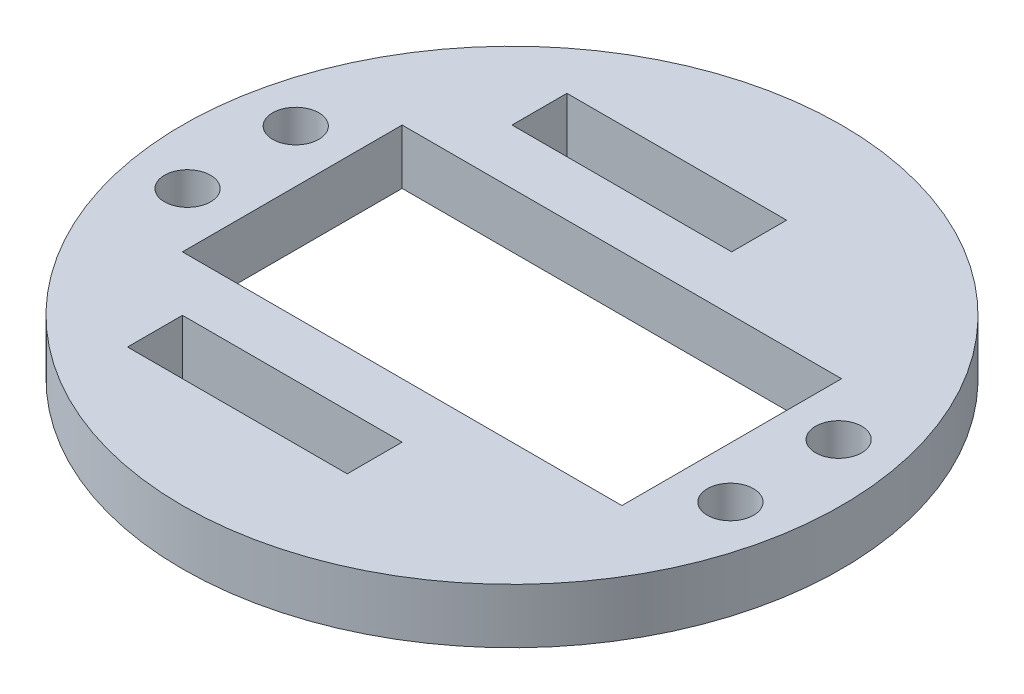
ISO-10303-21;
HEADER;
FILE_DESCRIPTION(('STEP AP214'),'2;1');
FILE_NAME('part.step','',(''),(''),'','','');
FILE_SCHEMA(('AUTOMOTIVE_DESIGN { 1 0 10303 214 1 1 1 1 }'));
ENDSEC;
DATA;
#1=APPLICATION_CONTEXT('core data for automotive mechanical design processes');
#2=APPLICATION_PROTOCOL_DEFINITION('international standard','automotive_design',2000,#1);
#3=PRODUCT_CONTEXT('',#1,'mechanical');
#4=PRODUCT('Part','Part','',(#3));
#5=PRODUCT_RELATED_PRODUCT_CATEGORY('part','',(#4));
#6=PRODUCT_DEFINITION_FORMATION('','',#4);
#7=PRODUCT_DEFINITION_CONTEXT('part definition',#1,'design');
#8=PRODUCT_DEFINITION('design','',#6,#7);
#9=PRODUCT_DEFINITION_SHAPE('','',#8);
#10=(LENGTH_UNIT() NAMED_UNIT(*) SI_UNIT(.MILLI.,.METRE.));
#11=(NAMED_UNIT(*) PLANE_ANGLE_UNIT() SI_UNIT($,.RADIAN.));
#12=(NAMED_UNIT(*) SI_UNIT($,.STERADIAN.) SOLID_ANGLE_UNIT());
#13=UNCERTAINTY_MEASURE_WITH_UNIT(LENGTH_MEASURE(1.E-05),#10,'distance_accuracy_value','');
#14=(GEOMETRIC_REPRESENTATION_CONTEXT(3) GLOBAL_UNCERTAINTY_ASSIGNED_CONTEXT((#13)) GLOBAL_UNIT_ASSIGNED_CONTEXT((#10,
#11,#12)) REPRESENTATION_CONTEXT('',''));
#15=CARTESIAN_POINT('',(0.,0.,0.));
#16=DIRECTION('',(0.,0.,1.));
#17=DIRECTION('',(1.,0.,0.));
#18=AXIS2_PLACEMENT_3D('',#15,#16,#17);
#19=CARTESIAN_POINT('',(0.,5.,0.));
#20=DIRECTION('',(0.,-1.,0.));
#21=DIRECTION('',(0.,0.,-1.));
#22=AXIS2_PLACEMENT_3D('',#19,#20,#21);
#23=CYLINDRICAL_SURFACE('',#22,30.);
#24=CARTESIAN_POINT('',(0.,5.,0.));
#25=DIRECTION('',(0.,1.,0.));
#26=DIRECTION('',(0.,0.,1.));
#27=AXIS2_PLACEMENT_3D('',#24,#25,#26);
#28=CIRCLE('',#27,30.);
#29=CARTESIAN_POINT('',(0.,5.,30.));
#30=VERTEX_POINT('',#29);
#31=EDGE_CURVE('E206',#30,#30,#28,.T.);
#32=ORIENTED_EDGE('',*,*,#31,.F.);
#33=EDGE_LOOP('',(#32));
#34=FACE_BOUND('',#33,.T.);
#35=CARTESIAN_POINT('',(0.,0.,0.));
#36=DIRECTION('',(0.,1.,0.));
#37=DIRECTION('',(0.,0.,1.));
#38=AXIS2_PLACEMENT_3D('',#35,#36,#37);
#39=CIRCLE('',#38,30.);
#40=CARTESIAN_POINT('',(0.,0.,30.));
#41=VERTEX_POINT('',#40);
#42=EDGE_CURVE('E199',#41,#41,#39,.T.);
#43=ORIENTED_EDGE('',*,*,#42,.T.);
#44=EDGE_LOOP('',(#43));
#45=FACE_BOUND('',#44,.T.);
#46=ADVANCED_FACE('F33',(#34,#45),#23,.T.);
#47=CARTESIAN_POINT('',(0.,5.,0.));
#48=DIRECTION('',(0.,1.,0.));
#49=DIRECTION('',(0.,0.,1.));
#50=AXIS2_PLACEMENT_3D('',#47,#48,#49);
#51=PLANE('',#50);
#52=CARTESIAN_POINT('',(24.6611456180001,5.,-5.07499999999998));
#53=DIRECTION('',(0.,-1.,0.));
#54=DIRECTION('',(0.,0.,-1.));
#55=AXIS2_PLACEMENT_3D('',#52,#53,#54);
#56=CIRCLE('',#55,2.10000000000001);
#57=CARTESIAN_POINT('',(24.6611456180001,5.,-7.17499999999999));
#58=VERTEX_POINT('',#57);
#59=EDGE_CURVE('E435',#58,#58,#56,.T.);
#60=ORIENTED_EDGE('',*,*,#59,.T.);
#61=EDGE_LOOP('',(#60));
#62=FACE_BOUND('',#61,.T.);
#63=CARTESIAN_POINT('',(24.6611456180001,5.,4.77500000000002));
#64=DIRECTION('',(0.,-1.,0.));
#65=DIRECTION('',(0.,0.,-1.));
#66=AXIS2_PLACEMENT_3D('',#63,#64,#65);
#67=CIRCLE('',#66,2.10000000000001);
#68=CARTESIAN_POINT('',(24.6611456180001,5.,2.67500000000001));
#69=VERTEX_POINT('',#68);
#70=EDGE_CURVE('E456',#69,#69,#67,.T.);
#71=ORIENTED_EDGE('',*,*,#70,.T.);
#72=EDGE_LOOP('',(#71));
#73=FACE_BOUND('',#72,.T.);
#74=CARTESIAN_POINT('',(-24.7611456180002,5.,4.77500000000002));
#75=DIRECTION('',(0.,-1.,0.));
#76=DIRECTION('',(0.,0.,-1.));
#77=AXIS2_PLACEMENT_3D('',#74,#75,#76);
#78=CIRCLE('',#77,2.10000000000001);
#79=CARTESIAN_POINT('',(-24.7611456180002,5.,2.67500000000001));
#80=VERTEX_POINT('',#79);
#81=EDGE_CURVE('E447',#80,#80,#78,.T.);
#82=ORIENTED_EDGE('',*,*,#81,.T.);
#83=EDGE_LOOP('',(#82));
#84=FACE_BOUND('',#83,.T.);
#85=CARTESIAN_POINT('',(-24.7611456180002,5.,-5.07499999999998));
#86=DIRECTION('',(0.,-1.,0.));
#87=DIRECTION('',(0.,0.,-1.));
#88=AXIS2_PLACEMENT_3D('',#85,#86,#87);
#89=CIRCLE('',#88,2.10000000000001);
#90=CARTESIAN_POINT('',(-24.7611456180002,5.,-7.17499999999999));
#91=VERTEX_POINT('',#90);
#92=EDGE_CURVE('E157',#91,#91,#89,.T.);
#93=ORIENTED_EDGE('',*,*,#92,.T.);
#94=EDGE_LOOP('',(#93));
#95=FACE_BOUND('',#94,.T.);
#96=DIRECTION('',(0.,0.,1.));
#97=VECTOR('',#96,1.);
#98=CARTESIAN_POINT('',(-15.,5.,-15.));
#99=LINE('',#98,#97);
#100=CARTESIAN_POINT('',(-15.,5.,-20.));
#101=VERTEX_POINT('',#100);
#102=CARTESIAN_POINT('',(-15.,5.,-15.));
#103=VERTEX_POINT('',#102);
#104=EDGE_CURVE('E47',#101,#103,#99,.T.);
#105=ORIENTED_EDGE('',*,*,#104,.F.);
#106=DIRECTION('',(-1.,0.,0.));
#107=VECTOR('',#106,1.);
#108=CARTESIAN_POINT('',(-15.,5.,-20.));
#109=LINE('',#108,#107);
#110=CARTESIAN_POINT('',(5.,5.,-20.));
#111=VERTEX_POINT('',#110);
#112=EDGE_CURVE('E145',#111,#101,#109,.T.);
#113=ORIENTED_EDGE('',*,*,#112,.F.);
#114=DIRECTION('',(0.,0.,-1.));
#115=VECTOR('',#114,1.);
#116=CARTESIAN_POINT('',(5.,5.,-20.));
#117=LINE('',#116,#115);
#118=CARTESIAN_POINT('',(5.,5.,-15.));
#119=VERTEX_POINT('',#118);
#120=EDGE_CURVE('E128',#119,#111,#117,.T.);
#121=ORIENTED_EDGE('',*,*,#120,.F.);
#122=DIRECTION('',(1.,0.,0.));
#123=VECTOR('',#122,1.);
#124=CARTESIAN_POINT('',(5.,5.,-15.));
#125=LINE('',#124,#123);
#126=EDGE_CURVE('E138',#103,#119,#125,.T.);
#127=ORIENTED_EDGE('',*,*,#126,.F.);
#128=EDGE_LOOP('',(#105,#113,#121,#127));
#129=FACE_BOUND('',#128,.T.);
#130=DIRECTION('',(0.,0.,-1.));
#131=VECTOR('',#130,1.);
#132=CARTESIAN_POINT('',(5.,5.,20.));
#133=LINE('',#132,#131);
#134=CARTESIAN_POINT('',(5.,5.,20.));
#135=VERTEX_POINT('',#134);
#136=CARTESIAN_POINT('',(5.,5.,15.));
#137=VERTEX_POINT('',#136);
#138=EDGE_CURVE('E55',#135,#137,#133,.T.);
#139=ORIENTED_EDGE('',*,*,#138,.F.);
#140=DIRECTION('',(1.,0.,0.));
#141=VECTOR('',#140,1.);
#142=CARTESIAN_POINT('',(-15.,5.,20.));
#143=LINE('',#142,#141);
#144=CARTESIAN_POINT('',(-15.,5.,20.));
#145=VERTEX_POINT('',#144);
#146=EDGE_CURVE('E163',#145,#135,#143,.T.);
#147=ORIENTED_EDGE('',*,*,#146,.F.);
#148=DIRECTION('',(0.,0.,1.));
#149=VECTOR('',#148,1.);
#150=CARTESIAN_POINT('',(-15.,5.,15.));
#151=LINE('',#150,#149);
#152=CARTESIAN_POINT('',(-15.,5.,15.));
#153=VERTEX_POINT('',#152);
#154=EDGE_CURVE('E160',#153,#145,#151,.T.);
#155=ORIENTED_EDGE('',*,*,#154,.F.);
#156=DIRECTION('',(-1.,0.,0.));
#157=VECTOR('',#156,1.);
#158=CARTESIAN_POINT('',(5.,5.,15.));
#159=LINE('',#158,#157);
#160=EDGE_CURVE('E156',#137,#153,#159,.T.);
#161=ORIENTED_EDGE('',*,*,#160,.F.);
#162=EDGE_LOOP('',(#139,#147,#155,#161));
#163=FACE_BOUND('',#162,.T.);
#164=DIRECTION('',(0.,0.,-1.));
#165=VECTOR('',#164,1.);
#166=CARTESIAN_POINT('',(20.,5.,10.));
#167=LINE('',#166,#165);
#168=CARTESIAN_POINT('',(20.,5.,10.));
#169=VERTEX_POINT('',#168);
#170=CARTESIAN_POINT('',(20.,5.,-10.));
#171=VERTEX_POINT('',#170);
#172=EDGE_CURVE('E152',#169,#171,#167,.T.);
#173=ORIENTED_EDGE('',*,*,#172,.F.);
#174=DIRECTION('',(1.,0.,0.));
#175=VECTOR('',#174,1.);
#176=CARTESIAN_POINT('',(-20.,5.,10.));
#177=LINE('',#176,#175);
#178=CARTESIAN_POINT('',(-20.,5.,10.));
#179=VERTEX_POINT('',#178);
#180=EDGE_CURVE('E178',#179,#169,#177,.T.);
#181=ORIENTED_EDGE('',*,*,#180,.F.);
#182=DIRECTION('',(0.,0.,1.));
#183=VECTOR('',#182,1.);
#184=CARTESIAN_POINT('',(-20.,5.,10.));
#185=LINE('',#184,#183);
#186=CARTESIAN_POINT('',(-20.,5.,-10.));
#187=VERTEX_POINT('',#186);
#188=EDGE_CURVE('E192',#187,#179,#185,.T.);
#189=ORIENTED_EDGE('',*,*,#188,.F.);
#190=DIRECTION('',(-1.,0.,0.));
#191=VECTOR('',#190,1.);
#192=CARTESIAN_POINT('',(-20.,5.,-10.));
#193=LINE('',#192,#191);
#194=EDGE_CURVE('E189',#171,#187,#193,.T.);
#195=ORIENTED_EDGE('',*,*,#194,.F.);
#196=EDGE_LOOP('',(#173,#181,#189,#195));
#197=FACE_BOUND('',#196,.T.);
#198=ORIENTED_EDGE('',*,*,#31,.T.);
#199=EDGE_LOOP('',(#198));
#200=FACE_BOUND('',#199,.T.);
#201=ADVANCED_FACE('F142',(#62,#73,#84,#95,#129,#163,#197,#200),#51,.T.);
#202=CARTESIAN_POINT('',(0.,0.,0.));
#203=DIRECTION('',(0.,1.,0.));
#204=DIRECTION('',(0.,0.,1.));
#205=AXIS2_PLACEMENT_3D('',#202,#203,#204);
#206=PLANE('',#205);
#207=CARTESIAN_POINT('',(24.6611456180001,0.,-5.07499999999998));
#208=DIRECTION('',(0.,-1.,0.));
#209=DIRECTION('',(0.,0.,-1.));
#210=AXIS2_PLACEMENT_3D('',#207,#208,#209);
#211=CIRCLE('',#210,2.10000000000001);
#212=CARTESIAN_POINT('',(24.6611456180001,0.,-7.17499999999999));
#213=VERTEX_POINT('',#212);
#214=EDGE_CURVE('E437',#213,#213,#211,.T.);
#215=ORIENTED_EDGE('',*,*,#214,.F.);
#216=EDGE_LOOP('',(#215));
#217=FACE_BOUND('',#216,.T.);
#218=CARTESIAN_POINT('',(24.6611456180001,0.,4.77500000000002));
#219=DIRECTION('',(0.,-1.,0.));
#220=DIRECTION('',(0.,0.,-1.));
#221=AXIS2_PLACEMENT_3D('',#218,#219,#220);
#222=CIRCLE('',#221,2.10000000000001);
#223=CARTESIAN_POINT('',(24.6611456180001,0.,2.67500000000001));
#224=VERTEX_POINT('',#223);
#225=EDGE_CURVE('E439',#224,#224,#222,.T.);
#226=ORIENTED_EDGE('',*,*,#225,.F.);
#227=EDGE_LOOP('',(#226));
#228=FACE_BOUND('',#227,.T.);
#229=CARTESIAN_POINT('',(-24.7611456180002,0.,4.77500000000002));
#230=DIRECTION('',(0.,-1.,0.));
#231=DIRECTION('',(0.,0.,-1.));
#232=AXIS2_PLACEMENT_3D('',#229,#230,#231);
#233=CIRCLE('',#232,2.10000000000001);
#234=CARTESIAN_POINT('',(-24.7611456180002,0.,2.67500000000001));
#235=VERTEX_POINT('',#234);
#236=EDGE_CURVE('E451',#235,#235,#233,.T.);
#237=ORIENTED_EDGE('',*,*,#236,.F.);
#238=EDGE_LOOP('',(#237));
#239=FACE_BOUND('',#238,.T.);
#240=CARTESIAN_POINT('',(-24.7611456180002,0.,-5.07499999999998));
#241=DIRECTION('',(0.,-1.,0.));
#242=DIRECTION('',(0.,0.,-1.));
#243=AXIS2_PLACEMENT_3D('',#240,#241,#242);
#244=CIRCLE('',#243,2.10000000000001);
#245=CARTESIAN_POINT('',(-24.7611456180002,0.,-7.17499999999999));
#246=VERTEX_POINT('',#245);
#247=EDGE_CURVE('E445',#246,#246,#244,.T.);
#248=ORIENTED_EDGE('',*,*,#247,.F.);
#249=EDGE_LOOP('',(#248));
#250=FACE_BOUND('',#249,.T.);
#251=DIRECTION('',(-1.,0.,0.));
#252=VECTOR('',#251,1.);
#253=CARTESIAN_POINT('',(0.,0.,-20.));
#254=LINE('',#253,#252);
#255=CARTESIAN_POINT('',(5.,0.,-20.));
#256=VERTEX_POINT('',#255);
#257=CARTESIAN_POINT('',(-15.,0.,-20.));
#258=VERTEX_POINT('',#257);
#259=EDGE_CURVE('E40',#256,#258,#254,.T.);
#260=ORIENTED_EDGE('',*,*,#259,.T.);
#261=DIRECTION('',(0.,0.,1.));
#262=VECTOR('',#261,1.);
#263=CARTESIAN_POINT('',(-15.,0.,0.));
#264=LINE('',#263,#262);
#265=CARTESIAN_POINT('',(-15.,0.,-15.));
#266=VERTEX_POINT('',#265);
#267=EDGE_CURVE('E11',#258,#266,#264,.T.);
#268=ORIENTED_EDGE('',*,*,#267,.T.);
#269=DIRECTION('',(1.,0.,0.));
#270=VECTOR('',#269,1.);
#271=CARTESIAN_POINT('',(0.,0.,-15.));
#272=LINE('',#271,#270);
#273=CARTESIAN_POINT('',(5.,0.,-15.));
#274=VERTEX_POINT('',#273);
#275=EDGE_CURVE('E223',#266,#274,#272,.T.);
#276=ORIENTED_EDGE('',*,*,#275,.T.);
#277=DIRECTION('',(0.,0.,-1.));
#278=VECTOR('',#277,1.);
#279=CARTESIAN_POINT('',(5.,0.,0.));
#280=LINE('',#279,#278);
#281=EDGE_CURVE('E131',#274,#256,#280,.T.);
#282=ORIENTED_EDGE('',*,*,#281,.T.);
#283=EDGE_LOOP('',(#260,#268,#276,#282));
#284=FACE_BOUND('',#283,.T.);
#285=DIRECTION('',(1.,0.,0.));
#286=VECTOR('',#285,1.);
#287=CARTESIAN_POINT('',(0.,0.,20.));
#288=LINE('',#287,#286);
#289=CARTESIAN_POINT('',(-15.,0.,20.));
#290=VERTEX_POINT('',#289);
#291=CARTESIAN_POINT('',(5.,0.,20.));
#292=VERTEX_POINT('',#291);
#293=EDGE_CURVE('E217',#290,#292,#288,.T.);
#294=ORIENTED_EDGE('',*,*,#293,.T.);
#295=DIRECTION('',(0.,0.,-1.));
#296=VECTOR('',#295,1.);
#297=CARTESIAN_POINT('',(5.,0.,0.));
#298=LINE('',#297,#296);
#299=CARTESIAN_POINT('',(5.,0.,15.));
#300=VERTEX_POINT('',#299);
#301=EDGE_CURVE('E220',#292,#300,#298,.T.);
#302=ORIENTED_EDGE('',*,*,#301,.T.);
#303=DIRECTION('',(-1.,0.,0.));
#304=VECTOR('',#303,1.);
#305=CARTESIAN_POINT('',(0.,0.,15.));
#306=LINE('',#305,#304);
#307=CARTESIAN_POINT('',(-15.,0.,15.));
#308=VERTEX_POINT('',#307);
#309=EDGE_CURVE('E209',#300,#308,#306,.T.);
#310=ORIENTED_EDGE('',*,*,#309,.T.);
#311=DIRECTION('',(0.,0.,1.));
#312=VECTOR('',#311,1.);
#313=CARTESIAN_POINT('',(-15.,0.,0.));
#314=LINE('',#313,#312);
#315=EDGE_CURVE('E214',#308,#290,#314,.T.);
#316=ORIENTED_EDGE('',*,*,#315,.T.);
#317=EDGE_LOOP('',(#294,#302,#310,#316));
#318=FACE_BOUND('',#317,.T.);
#319=DIRECTION('',(1.,0.,0.));
#320=VECTOR('',#319,1.);
#321=CARTESIAN_POINT('',(-20.,0.,10.));
#322=LINE('',#321,#320);
#323=CARTESIAN_POINT('',(-20.,0.,10.));
#324=VERTEX_POINT('',#323);
#325=CARTESIAN_POINT('',(20.,0.,10.));
#326=VERTEX_POINT('',#325);
#327=EDGE_CURVE('E184',#324,#326,#322,.T.);
#328=ORIENTED_EDGE('',*,*,#327,.T.);
#329=DIRECTION('',(0.,0.,-1.));
#330=VECTOR('',#329,1.);
#331=CARTESIAN_POINT('',(20.,0.,10.));
#332=LINE('',#331,#330);
#333=CARTESIAN_POINT('',(20.,0.,-10.));
#334=VERTEX_POINT('',#333);
#335=EDGE_CURVE('E174',#326,#334,#332,.T.);
#336=ORIENTED_EDGE('',*,*,#335,.T.);
#337=DIRECTION('',(-1.,0.,0.));
#338=VECTOR('',#337,1.);
#339=CARTESIAN_POINT('',(-20.,0.,-10.));
#340=LINE('',#339,#338);
#341=CARTESIAN_POINT('',(-20.,0.,-10.));
#342=VERTEX_POINT('',#341);
#343=EDGE_CURVE('E177',#334,#342,#340,.T.);
#344=ORIENTED_EDGE('',*,*,#343,.T.);
#345=DIRECTION('',(0.,0.,1.));
#346=VECTOR('',#345,1.);
#347=CARTESIAN_POINT('',(-20.,0.,10.));
#348=LINE('',#347,#346);
#349=EDGE_CURVE('E181',#342,#324,#348,.T.);
#350=ORIENTED_EDGE('',*,*,#349,.T.);
#351=EDGE_LOOP('',(#328,#336,#344,#350));
#352=FACE_BOUND('',#351,.T.);
#353=ORIENTED_EDGE('',*,*,#42,.F.);
#354=EDGE_LOOP('',(#353));
#355=FACE_BOUND('',#354,.T.);
#356=ADVANCED_FACE('F227',(#217,#228,#239,#250,#284,#318,#352,#355),#206,.F.);
#357=CARTESIAN_POINT('',(20.,0.,10.));
#358=DIRECTION('',(1.,0.,0.));
#359=DIRECTION('',(0.,0.,-1.));
#360=AXIS2_PLACEMENT_3D('',#357,#358,#359);
#361=PLANE('',#360);
#362=ORIENTED_EDGE('',*,*,#172,.T.);
#363=DIRECTION('',(0.,1.,0.));
#364=VECTOR('',#363,1.);
#365=CARTESIAN_POINT('',(20.,0.,-10.));
#366=LINE('',#365,#364);
#367=EDGE_CURVE('E187',#334,#171,#366,.T.);
#368=ORIENTED_EDGE('',*,*,#367,.F.);
#369=ORIENTED_EDGE('',*,*,#335,.F.);
#370=DIRECTION('',(0.,1.,0.));
#371=VECTOR('',#370,1.);
#372=CARTESIAN_POINT('',(20.,0.,10.));
#373=LINE('',#372,#371);
#374=EDGE_CURVE('E197',#326,#169,#373,.T.);
#375=ORIENTED_EDGE('',*,*,#374,.T.);
#376=EDGE_LOOP('',(#362,#368,#369,#375));
#377=FACE_BOUND('',#376,.T.);
#378=ADVANCED_FACE('F259',(#377),#361,.F.);
#379=CARTESIAN_POINT('',(-20.,0.,10.));
#380=DIRECTION('',(0.,0.,1.));
#381=DIRECTION('',(1.,0.,0.));
#382=AXIS2_PLACEMENT_3D('',#379,#380,#381);
#383=PLANE('',#382);
#384=ORIENTED_EDGE('',*,*,#180,.T.);
#385=ORIENTED_EDGE('',*,*,#374,.F.);
#386=ORIENTED_EDGE('',*,*,#327,.F.);
#387=DIRECTION('',(0.,1.,0.));
#388=VECTOR('',#387,1.);
#389=CARTESIAN_POINT('',(-20.,0.,10.));
#390=LINE('',#389,#388);
#391=EDGE_CURVE('E200',#324,#179,#390,.T.);
#392=ORIENTED_EDGE('',*,*,#391,.T.);
#393=EDGE_LOOP('',(#384,#385,#386,#392));
#394=FACE_BOUND('',#393,.T.);
#395=ADVANCED_FACE('F265',(#394),#383,.F.);
#396=CARTESIAN_POINT('',(-20.,0.,10.));
#397=DIRECTION('',(-1.,0.,0.));
#398=DIRECTION('',(0.,0.,1.));
#399=AXIS2_PLACEMENT_3D('',#396,#397,#398);
#400=PLANE('',#399);
#401=ORIENTED_EDGE('',*,*,#188,.T.);
#402=ORIENTED_EDGE('',*,*,#391,.F.);
#403=ORIENTED_EDGE('',*,*,#349,.F.);
#404=DIRECTION('',(0.,1.,0.));
#405=VECTOR('',#404,1.);
#406=CARTESIAN_POINT('',(-20.,0.,-10.));
#407=LINE('',#406,#405);
#408=EDGE_CURVE('E202',#342,#187,#407,.T.);
#409=ORIENTED_EDGE('',*,*,#408,.T.);
#410=EDGE_LOOP('',(#401,#402,#403,#409));
#411=FACE_BOUND('',#410,.T.);
#412=ADVANCED_FACE('F275',(#411),#400,.F.);
#413=CARTESIAN_POINT('',(-20.,0.,-10.));
#414=DIRECTION('',(0.,0.,-1.));
#415=DIRECTION('',(-1.,0.,0.));
#416=AXIS2_PLACEMENT_3D('',#413,#414,#415);
#417=PLANE('',#416);
#418=ORIENTED_EDGE('',*,*,#194,.T.);
#419=ORIENTED_EDGE('',*,*,#408,.F.);
#420=ORIENTED_EDGE('',*,*,#343,.F.);
#421=ORIENTED_EDGE('',*,*,#367,.T.);
#422=EDGE_LOOP('',(#418,#419,#420,#421));
#423=FACE_BOUND('',#422,.T.);
#424=ADVANCED_FACE('F271',(#423),#417,.F.);
#425=CARTESIAN_POINT('',(5.,-5.,20.));
#426=DIRECTION('',(1.,0.,0.));
#427=DIRECTION('',(0.,0.,-1.));
#428=AXIS2_PLACEMENT_3D('',#425,#426,#427);
#429=PLANE('',#428);
#430=DIRECTION('',(0.,1.,0.));
#431=VECTOR('',#430,1.);
#432=CARTESIAN_POINT('',(5.,-5.,20.));
#433=LINE('',#432,#431);
#434=EDGE_CURVE('E167',#292,#135,#433,.T.);
#435=ORIENTED_EDGE('',*,*,#434,.T.);
#436=ORIENTED_EDGE('',*,*,#138,.T.);
#437=DIRECTION('',(0.,1.,0.));
#438=VECTOR('',#437,1.);
#439=CARTESIAN_POINT('',(5.,-5.,15.));
#440=LINE('',#439,#438);
#441=EDGE_CURVE('E166',#300,#137,#440,.T.);
#442=ORIENTED_EDGE('',*,*,#441,.F.);
#443=ORIENTED_EDGE('',*,*,#301,.F.);
#444=EDGE_LOOP('',(#435,#436,#442,#443));
#445=FACE_BOUND('',#444,.T.);
#446=ADVANCED_FACE('F274',(#445),#429,.F.);
#447=CARTESIAN_POINT('',(-15.,-5.,20.));
#448=DIRECTION('',(0.,0.,1.));
#449=DIRECTION('',(1.,0.,0.));
#450=AXIS2_PLACEMENT_3D('',#447,#448,#449);
#451=PLANE('',#450);
#452=DIRECTION('',(0.,1.,0.));
#453=VECTOR('',#452,1.);
#454=CARTESIAN_POINT('',(-15.,-5.,20.));
#455=LINE('',#454,#453);
#456=EDGE_CURVE('E169',#290,#145,#455,.T.);
#457=ORIENTED_EDGE('',*,*,#456,.T.);
#458=ORIENTED_EDGE('',*,*,#146,.T.);
#459=ORIENTED_EDGE('',*,*,#434,.F.);
#460=ORIENTED_EDGE('',*,*,#293,.F.);
#461=EDGE_LOOP('',(#457,#458,#459,#460));
#462=FACE_BOUND('',#461,.T.);
#463=ADVANCED_FACE('F284',(#462),#451,.F.);
#464=CARTESIAN_POINT('',(-15.,-5.,15.));
#465=DIRECTION('',(-1.,0.,0.));
#466=DIRECTION('',(0.,0.,1.));
#467=AXIS2_PLACEMENT_3D('',#464,#465,#466);
#468=PLANE('',#467);
#469=DIRECTION('',(0.,1.,0.));
#470=VECTOR('',#469,1.);
#471=CARTESIAN_POINT('',(-15.,-5.,15.));
#472=LINE('',#471,#470);
#473=EDGE_CURVE('E171',#308,#153,#472,.T.);
#474=ORIENTED_EDGE('',*,*,#473,.T.);
#475=ORIENTED_EDGE('',*,*,#154,.T.);
#476=ORIENTED_EDGE('',*,*,#456,.F.);
#477=ORIENTED_EDGE('',*,*,#315,.F.);
#478=EDGE_LOOP('',(#474,#475,#476,#477));
#479=FACE_BOUND('',#478,.T.);
#480=ADVANCED_FACE('F241',(#479),#468,.F.);
#481=CARTESIAN_POINT('',(5.,-5.,15.));
#482=DIRECTION('',(0.,0.,-1.));
#483=DIRECTION('',(-1.,0.,0.));
#484=AXIS2_PLACEMENT_3D('',#481,#482,#483);
#485=PLANE('',#484);
#486=ORIENTED_EDGE('',*,*,#441,.T.);
#487=ORIENTED_EDGE('',*,*,#160,.T.);
#488=ORIENTED_EDGE('',*,*,#473,.F.);
#489=ORIENTED_EDGE('',*,*,#309,.F.);
#490=EDGE_LOOP('',(#486,#487,#488,#489));
#491=FACE_BOUND('',#490,.T.);
#492=ADVANCED_FACE('F234',(#491),#485,.F.);
#493=CARTESIAN_POINT('',(-15.,-5.,-15.));
#494=DIRECTION('',(-1.,0.,0.));
#495=DIRECTION('',(0.,0.,1.));
#496=AXIS2_PLACEMENT_3D('',#493,#494,#495);
#497=PLANE('',#496);
#498=DIRECTION('',(0.,1.,0.));
#499=VECTOR('',#498,1.);
#500=CARTESIAN_POINT('',(-15.,-5.,-20.));
#501=LINE('',#500,#499);
#502=EDGE_CURVE('E150',#258,#101,#501,.T.);
#503=ORIENTED_EDGE('',*,*,#502,.T.);
#504=ORIENTED_EDGE('',*,*,#104,.T.);
#505=DIRECTION('',(0.,1.,0.));
#506=VECTOR('',#505,1.);
#507=CARTESIAN_POINT('',(-15.,-5.,-15.));
#508=LINE('',#507,#506);
#509=EDGE_CURVE('E135',#266,#103,#508,.T.);
#510=ORIENTED_EDGE('',*,*,#509,.F.);
#511=ORIENTED_EDGE('',*,*,#267,.F.);
#512=EDGE_LOOP('',(#503,#504,#510,#511));
#513=FACE_BOUND('',#512,.T.);
#514=ADVANCED_FACE('F232',(#513),#497,.F.);
#515=CARTESIAN_POINT('',(-15.,-5.,-20.));
#516=DIRECTION('',(0.,0.,-1.));
#517=DIRECTION('',(-1.,0.,0.));
#518=AXIS2_PLACEMENT_3D('',#515,#516,#517);
#519=PLANE('',#518);
#520=DIRECTION('',(0.,1.,0.));
#521=VECTOR('',#520,1.);
#522=CARTESIAN_POINT('',(5.,-5.,-20.));
#523=LINE('',#522,#521);
#524=EDGE_CURVE('E134',#256,#111,#523,.T.);
#525=ORIENTED_EDGE('',*,*,#524,.T.);
#526=ORIENTED_EDGE('',*,*,#112,.T.);
#527=ORIENTED_EDGE('',*,*,#502,.F.);
#528=ORIENTED_EDGE('',*,*,#259,.F.);
#529=EDGE_LOOP('',(#525,#526,#527,#528));
#530=FACE_BOUND('',#529,.T.);
#531=ADVANCED_FACE('F231',(#530),#519,.F.);
#532=CARTESIAN_POINT('',(5.,-5.,-20.));
#533=DIRECTION('',(1.,0.,0.));
#534=DIRECTION('',(0.,0.,-1.));
#535=AXIS2_PLACEMENT_3D('',#532,#533,#534);
#536=PLANE('',#535);
#537=DIRECTION('',(0.,1.,0.));
#538=VECTOR('',#537,1.);
#539=CARTESIAN_POINT('',(5.,-5.,-15.));
#540=LINE('',#539,#538);
#541=EDGE_CURVE('E123',#274,#119,#540,.T.);
#542=ORIENTED_EDGE('',*,*,#541,.T.);
#543=ORIENTED_EDGE('',*,*,#120,.T.);
#544=ORIENTED_EDGE('',*,*,#524,.F.);
#545=ORIENTED_EDGE('',*,*,#281,.F.);
#546=EDGE_LOOP('',(#542,#543,#544,#545));
#547=FACE_BOUND('',#546,.T.);
#548=ADVANCED_FACE('F125',(#547),#536,.F.);
#549=CARTESIAN_POINT('',(5.,-5.,-15.));
#550=DIRECTION('',(0.,0.,1.));
#551=DIRECTION('',(1.,0.,0.));
#552=AXIS2_PLACEMENT_3D('',#549,#550,#551);
#553=PLANE('',#552);
#554=ORIENTED_EDGE('',*,*,#509,.T.);
#555=ORIENTED_EDGE('',*,*,#126,.T.);
#556=ORIENTED_EDGE('',*,*,#541,.F.);
#557=ORIENTED_EDGE('',*,*,#275,.F.);
#558=EDGE_LOOP('',(#554,#555,#556,#557));
#559=FACE_BOUND('',#558,.T.);
#560=ADVANCED_FACE('F139',(#559),#553,.F.);
#561=CARTESIAN_POINT('',(-24.7611456180002,5.,-5.07499999999998));
#562=DIRECTION('',(0.,-1.,0.));
#563=DIRECTION('',(0.,0.,-1.));
#564=AXIS2_PLACEMENT_3D('',#561,#562,#563);
#565=CYLINDRICAL_SURFACE('',#564,2.10000000000001);
#566=ORIENTED_EDGE('',*,*,#92,.F.);
#567=EDGE_LOOP('',(#566));
#568=FACE_BOUND('',#567,.T.);
#569=ORIENTED_EDGE('',*,*,#247,.T.);
#570=EDGE_LOOP('',(#569));
#571=FACE_BOUND('',#570,.T.);
#572=ADVANCED_FACE('F345',(#568,#571),#565,.F.);
#573=CARTESIAN_POINT('',(-24.7611456180002,5.,4.77500000000002));
#574=DIRECTION('',(0.,-1.,0.));
#575=DIRECTION('',(0.,0.,-1.));
#576=AXIS2_PLACEMENT_3D('',#573,#574,#575);
#577=CYLINDRICAL_SURFACE('',#576,2.10000000000001);
#578=ORIENTED_EDGE('',*,*,#81,.F.);
#579=EDGE_LOOP('',(#578));
#580=FACE_BOUND('',#579,.T.);
#581=ORIENTED_EDGE('',*,*,#236,.T.);
#582=EDGE_LOOP('',(#581));
#583=FACE_BOUND('',#582,.T.);
#584=ADVANCED_FACE('F398',(#580,#583),#577,.F.);
#585=CARTESIAN_POINT('',(24.6611456180001,5.,4.77500000000002));
#586=DIRECTION('',(0.,-1.,0.));
#587=DIRECTION('',(0.,0.,-1.));
#588=AXIS2_PLACEMENT_3D('',#585,#586,#587);
#589=CYLINDRICAL_SURFACE('',#588,2.10000000000001);
#590=ORIENTED_EDGE('',*,*,#70,.F.);
#591=EDGE_LOOP('',(#590));
#592=FACE_BOUND('',#591,.T.);
#593=ORIENTED_EDGE('',*,*,#225,.T.);
#594=EDGE_LOOP('',(#593));
#595=FACE_BOUND('',#594,.T.);
#596=ADVANCED_FACE('F405',(#592,#595),#589,.F.);
#597=CARTESIAN_POINT('',(24.6611456180001,5.,-5.07499999999998));
#598=DIRECTION('',(0.,-1.,0.));
#599=DIRECTION('',(0.,0.,-1.));
#600=AXIS2_PLACEMENT_3D('',#597,#598,#599);
#601=CYLINDRICAL_SURFACE('',#600,2.10000000000001);
#602=ORIENTED_EDGE('',*,*,#59,.F.);
#603=EDGE_LOOP('',(#602));
#604=FACE_BOUND('',#603,.T.);
#605=ORIENTED_EDGE('',*,*,#214,.T.);
#606=EDGE_LOOP('',(#605));
#607=FACE_BOUND('',#606,.T.);
#608=ADVANCED_FACE('F413',(#604,#607),#601,.F.);
#609=CLOSED_SHELL('',(#46,#201,#356,#378,#395,#412,#424,#446,#463,#480,#492,#514,#531,#548,#560,
#572,#584,#596,#608));
#610=MANIFOLD_SOLID_BREP('B2',#609);
#611=ADVANCED_BREP_SHAPE_REPRESENTATION('',(#18,#610),#14);
#612=SHAPE_DEFINITION_REPRESENTATION(#9,#611);
ENDSEC;
END-ISO-10303-21;
